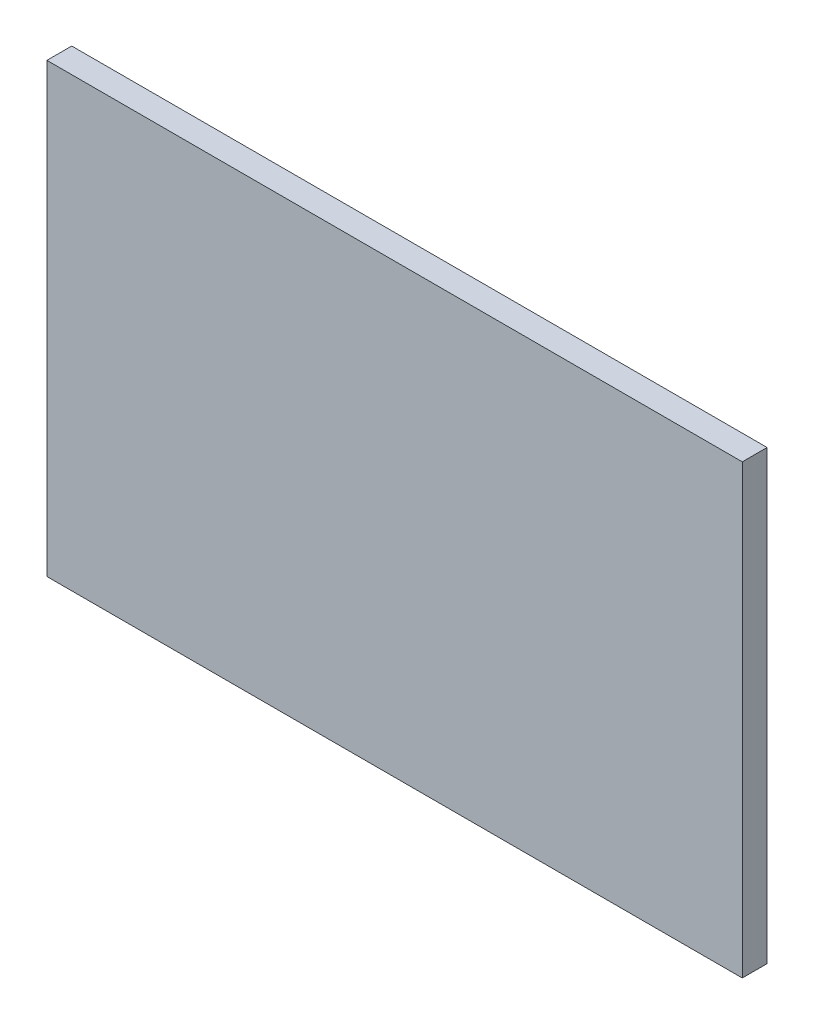
ISO-10303-21;
HEADER;
FILE_DESCRIPTION(('STEP AP214'),'2;1');
FILE_NAME('part.step','',(''),(''),'','','');
FILE_SCHEMA(('AUTOMOTIVE_DESIGN { 1 0 10303 214 1 1 1 1 }'));
ENDSEC;
DATA;
#1=APPLICATION_CONTEXT('core data for automotive mechanical design processes');
#2=APPLICATION_PROTOCOL_DEFINITION('international standard','automotive_design',2000,#1);
#3=PRODUCT_CONTEXT('',#1,'mechanical');
#4=PRODUCT('Part','Part','',(#3));
#5=PRODUCT_RELATED_PRODUCT_CATEGORY('part','',(#4));
#6=PRODUCT_DEFINITION_FORMATION('','',#4);
#7=PRODUCT_DEFINITION_CONTEXT('part definition',#1,'design');
#8=PRODUCT_DEFINITION('design','',#6,#7);
#9=PRODUCT_DEFINITION_SHAPE('','',#8);
#10=(LENGTH_UNIT() NAMED_UNIT(*) SI_UNIT(.MILLI.,.METRE.));
#11=(NAMED_UNIT(*) PLANE_ANGLE_UNIT() SI_UNIT($,.RADIAN.));
#12=(NAMED_UNIT(*) SI_UNIT($,.STERADIAN.) SOLID_ANGLE_UNIT());
#13=UNCERTAINTY_MEASURE_WITH_UNIT(LENGTH_MEASURE(1.E-05),#10,'distance_accuracy_value','');
#14=(GEOMETRIC_REPRESENTATION_CONTEXT(3) GLOBAL_UNCERTAINTY_ASSIGNED_CONTEXT((#13)) GLOBAL_UNIT_ASSIGNED_CONTEXT((#10,
#11,#12)) REPRESENTATION_CONTEXT('',''));
#15=CARTESIAN_POINT('',(0.,0.,0.));
#16=DIRECTION('',(0.,0.,1.));
#17=DIRECTION('',(1.,0.,0.));
#18=AXIS2_PLACEMENT_3D('',#15,#16,#17);
#19=CARTESIAN_POINT('',(0.,0.,3.175));
#20=DIRECTION('',(1.,0.,0.));
#21=DIRECTION('',(0.,0.,-1.));
#22=AXIS2_PLACEMENT_3D('',#19,#20,#21);
#23=PLANE('',#22);
#24=DIRECTION('',(0.,-1.,0.));
#25=VECTOR('',#24,1.);
#26=CARTESIAN_POINT('',(0.,0.,0.));
#27=LINE('',#26,#25);
#28=CARTESIAN_POINT('',(0.,57.15,0.));
#29=VERTEX_POINT('',#28);
#30=CARTESIAN_POINT('',(0.,0.,0.));
#31=VERTEX_POINT('',#30);
#32=EDGE_CURVE('E107',#29,#31,#27,.T.);
#33=ORIENTED_EDGE('',*,*,#32,.T.);
#34=DIRECTION('',(0.,0.,-1.));
#35=VECTOR('',#34,1.);
#36=CARTESIAN_POINT('',(0.,0.,3.175));
#37=LINE('',#36,#35);
#38=CARTESIAN_POINT('',(0.,0.,3.175));
#39=VERTEX_POINT('',#38);
#40=EDGE_CURVE('E11',#39,#31,#37,.T.);
#41=ORIENTED_EDGE('',*,*,#40,.F.);
#42=DIRECTION('',(0.,-1.,0.));
#43=VECTOR('',#42,1.);
#44=CARTESIAN_POINT('',(0.,0.,3.175));
#45=LINE('',#44,#43);
#46=CARTESIAN_POINT('',(0.,57.15,3.175));
#47=VERTEX_POINT('',#46);
#48=EDGE_CURVE('E91',#47,#39,#45,.T.);
#49=ORIENTED_EDGE('',*,*,#48,.F.);
#50=DIRECTION('',(0.,0.,-1.));
#51=VECTOR('',#50,1.);
#52=CARTESIAN_POINT('',(0.,57.15,3.175));
#53=LINE('',#52,#51);
#54=EDGE_CURVE('E103',#47,#29,#53,.T.);
#55=ORIENTED_EDGE('',*,*,#54,.T.);
#56=EDGE_LOOP('',(#33,#41,#49,#55));
#57=FACE_BOUND('',#56,.T.);
#58=ADVANCED_FACE('F39',(#57),#23,.F.);
#59=CARTESIAN_POINT('',(0.,0.,3.175));
#60=DIRECTION('',(0.,1.,0.));
#61=DIRECTION('',(0.,0.,1.));
#62=AXIS2_PLACEMENT_3D('',#59,#60,#61);
#63=PLANE('',#62);
#64=DIRECTION('',(1.,0.,0.));
#65=VECTOR('',#64,1.);
#66=CARTESIAN_POINT('',(0.,0.,0.));
#67=LINE('',#66,#65);
#68=CARTESIAN_POINT('',(88.9,0.,0.));
#69=VERTEX_POINT('',#68);
#70=EDGE_CURVE('E96',#31,#69,#67,.T.);
#71=ORIENTED_EDGE('',*,*,#70,.T.);
#72=DIRECTION('',(0.,0.,-1.));
#73=VECTOR('',#72,1.);
#74=CARTESIAN_POINT('',(88.9,0.,3.175));
#75=LINE('',#74,#73);
#76=CARTESIAN_POINT('',(88.9,0.,3.175));
#77=VERTEX_POINT('',#76);
#78=EDGE_CURVE('E48',#77,#69,#75,.T.);
#79=ORIENTED_EDGE('',*,*,#78,.F.);
#80=DIRECTION('',(1.,0.,0.));
#81=VECTOR('',#80,1.);
#82=CARTESIAN_POINT('',(0.,0.,3.175));
#83=LINE('',#82,#81);
#84=EDGE_CURVE('E86',#39,#77,#83,.T.);
#85=ORIENTED_EDGE('',*,*,#84,.F.);
#86=ORIENTED_EDGE('',*,*,#40,.T.);
#87=EDGE_LOOP('',(#71,#79,#85,#86));
#88=FACE_BOUND('',#87,.T.);
#89=ADVANCED_FACE('F95',(#88),#63,.F.);
#90=CARTESIAN_POINT('',(88.9,0.,3.175));
#91=DIRECTION('',(-1.,0.,0.));
#92=DIRECTION('',(0.,0.,1.));
#93=AXIS2_PLACEMENT_3D('',#90,#91,#92);
#94=PLANE('',#93);
#95=DIRECTION('',(0.,1.,0.));
#96=VECTOR('',#95,1.);
#97=CARTESIAN_POINT('',(88.9,0.,0.));
#98=LINE('',#97,#96);
#99=CARTESIAN_POINT('',(88.9,57.15,0.));
#100=VERTEX_POINT('',#99);
#101=EDGE_CURVE('E73',#69,#100,#98,.T.);
#102=ORIENTED_EDGE('',*,*,#101,.T.);
#103=DIRECTION('',(0.,0.,-1.));
#104=VECTOR('',#103,1.);
#105=CARTESIAN_POINT('',(88.9,57.15,3.175));
#106=LINE('',#105,#104);
#107=CARTESIAN_POINT('',(88.9,57.15,3.175));
#108=VERTEX_POINT('',#107);
#109=EDGE_CURVE('E98',#108,#100,#106,.T.);
#110=ORIENTED_EDGE('',*,*,#109,.F.);
#111=DIRECTION('',(0.,1.,0.));
#112=VECTOR('',#111,1.);
#113=CARTESIAN_POINT('',(88.9,0.,3.175));
#114=LINE('',#113,#112);
#115=EDGE_CURVE('E89',#77,#108,#114,.T.);
#116=ORIENTED_EDGE('',*,*,#115,.F.);
#117=ORIENTED_EDGE('',*,*,#78,.T.);
#118=EDGE_LOOP('',(#102,#110,#116,#117));
#119=FACE_BOUND('',#118,.T.);
#120=ADVANCED_FACE('F99',(#119),#94,.F.);
#121=CARTESIAN_POINT('',(0.,57.15,3.175));
#122=DIRECTION('',(0.,-1.,0.));
#123=DIRECTION('',(0.,0.,-1.));
#124=AXIS2_PLACEMENT_3D('',#121,#122,#123);
#125=PLANE('',#124);
#126=DIRECTION('',(-1.,0.,0.));
#127=VECTOR('',#126,1.);
#128=CARTESIAN_POINT('',(0.,57.15,0.));
#129=LINE('',#128,#127);
#130=EDGE_CURVE('E79',#100,#29,#129,.T.);
#131=ORIENTED_EDGE('',*,*,#130,.T.);
#132=ORIENTED_EDGE('',*,*,#54,.F.);
#133=DIRECTION('',(-1.,0.,0.));
#134=VECTOR('',#133,1.);
#135=CARTESIAN_POINT('',(0.,57.15,3.175));
#136=LINE('',#135,#134);
#137=EDGE_CURVE('E56',#108,#47,#136,.T.);
#138=ORIENTED_EDGE('',*,*,#137,.F.);
#139=ORIENTED_EDGE('',*,*,#109,.T.);
#140=EDGE_LOOP('',(#131,#132,#138,#139));
#141=FACE_BOUND('',#140,.T.);
#142=ADVANCED_FACE('F120',(#141),#125,.F.);
#143=CARTESIAN_POINT('',(0.,0.,3.175));
#144=DIRECTION('',(0.,0.,-1.));
#145=DIRECTION('',(-1.,0.,0.));
#146=AXIS2_PLACEMENT_3D('',#143,#144,#145);
#147=PLANE('',#146);
#148=ORIENTED_EDGE('',*,*,#48,.T.);
#149=ORIENTED_EDGE('',*,*,#84,.T.);
#150=ORIENTED_EDGE('',*,*,#115,.T.);
#151=ORIENTED_EDGE('',*,*,#137,.T.);
#152=EDGE_LOOP('',(#148,#149,#150,#151));
#153=FACE_BOUND('',#152,.T.);
#154=ADVANCED_FACE('F87',(#153),#147,.F.);
#155=CARTESIAN_POINT('',(0.,0.,0.));
#156=DIRECTION('',(0.,0.,-1.));
#157=DIRECTION('',(-1.,0.,0.));
#158=AXIS2_PLACEMENT_3D('',#155,#156,#157);
#159=PLANE('',#158);
#160=ORIENTED_EDGE('',*,*,#32,.F.);
#161=ORIENTED_EDGE('',*,*,#130,.F.);
#162=ORIENTED_EDGE('',*,*,#101,.F.);
#163=ORIENTED_EDGE('',*,*,#70,.F.);
#164=EDGE_LOOP('',(#160,#161,#162,#163));
#165=FACE_BOUND('',#164,.T.);
#166=ADVANCED_FACE('F123',(#165),#159,.T.);
#167=CLOSED_SHELL('',(#58,#89,#120,#142,#154,#166));
#168=MANIFOLD_SOLID_BREP('B2',#167);
#169=ADVANCED_BREP_SHAPE_REPRESENTATION('',(#18,#168),#14);
#170=SHAPE_DEFINITION_REPRESENTATION(#9,#169);
ENDSEC;
END-ISO-10303-21;
